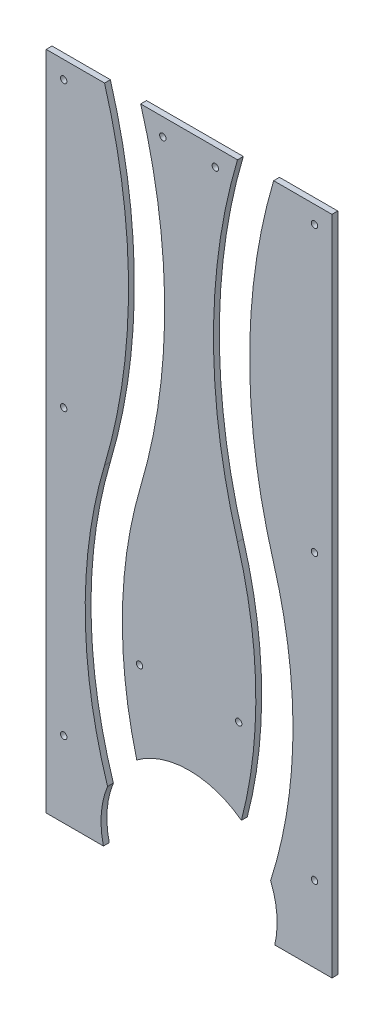
ISO-10303-21;
HEADER;
FILE_DESCRIPTION(('STEP AP214'),'2;1');
FILE_NAME('part.step','',(''),(''),'','','');
FILE_SCHEMA(('AUTOMOTIVE_DESIGN { 1 0 10303 214 1 1 1 1 }'));
ENDSEC;
DATA;
#1=APPLICATION_CONTEXT('core data for automotive mechanical design processes');
#2=APPLICATION_PROTOCOL_DEFINITION('international standard','automotive_design',2000,#1);
#3=PRODUCT_CONTEXT('',#1,'mechanical');
#4=PRODUCT('Part','Part','',(#3));
#5=PRODUCT_RELATED_PRODUCT_CATEGORY('part','',(#4));
#6=PRODUCT_DEFINITION_FORMATION('','',#4);
#7=PRODUCT_DEFINITION_CONTEXT('part definition',#1,'design');
#8=PRODUCT_DEFINITION('design','',#6,#7);
#9=PRODUCT_DEFINITION_SHAPE('','',#8);
#10=(LENGTH_UNIT() NAMED_UNIT(*) SI_UNIT(.MILLI.,.METRE.));
#11=(NAMED_UNIT(*) PLANE_ANGLE_UNIT() SI_UNIT($,.RADIAN.));
#12=(NAMED_UNIT(*) SI_UNIT($,.STERADIAN.) SOLID_ANGLE_UNIT());
#13=UNCERTAINTY_MEASURE_WITH_UNIT(LENGTH_MEASURE(1.E-05),#10,'distance_accuracy_value','');
#14=(GEOMETRIC_REPRESENTATION_CONTEXT(3) GLOBAL_UNCERTAINTY_ASSIGNED_CONTEXT((#13)) GLOBAL_UNIT_ASSIGNED_CONTEXT((#10,
#11,#12)) REPRESENTATION_CONTEXT('',''));
#15=CARTESIAN_POINT('',(0.,0.,0.));
#16=DIRECTION('',(0.,0.,1.));
#17=DIRECTION('',(1.,0.,0.));
#18=AXIS2_PLACEMENT_3D('',#15,#16,#17);
#19=CARTESIAN_POINT('',(0.,517.,5.));
#20=DIRECTION('',(0.,-1.,0.));
#21=DIRECTION('',(0.,0.,-1.));
#22=AXIS2_PLACEMENT_3D('',#19,#20,#21);
#23=PLANE('',#22);
#24=DIRECTION('',(0.,0.,1.));
#25=VECTOR('',#24,1.);
#26=CARTESIAN_POINT('',(50.,517.,-0.00100000000000013));
#27=LINE('',#26,#25);
#28=CARTESIAN_POINT('',(50.,517.,0.));
#29=VERTEX_POINT('',#28);
#30=CARTESIAN_POINT('',(50.,517.,5.));
#31=VERTEX_POINT('',#30);
#32=EDGE_CURVE('E77',#29,#31,#27,.T.);
#33=ORIENTED_EDGE('',*,*,#32,.F.);
#34=DIRECTION('',(-1.,0.,0.));
#35=VECTOR('',#34,1.);
#36=CARTESIAN_POINT('',(0.,517.,0.));
#37=LINE('',#36,#35);
#38=CARTESIAN_POINT('',(0.,517.,0.));
#39=VERTEX_POINT('',#38);
#40=EDGE_CURVE('E146',#29,#39,#37,.T.);
#41=ORIENTED_EDGE('',*,*,#40,.T.);
#42=DIRECTION('',(0.,0.,-1.));
#43=VECTOR('',#42,1.);
#44=CARTESIAN_POINT('',(0.,517.,5.));
#45=LINE('',#44,#43);
#46=CARTESIAN_POINT('',(0.,517.,5.));
#47=VERTEX_POINT('',#46);
#48=EDGE_CURVE('E122',#47,#39,#45,.T.);
#49=ORIENTED_EDGE('',*,*,#48,.F.);
#50=DIRECTION('',(-1.,0.,0.));
#51=VECTOR('',#50,1.);
#52=CARTESIAN_POINT('',(0.,517.,5.));
#53=LINE('',#52,#51);
#54=EDGE_CURVE('E95',#31,#47,#53,.T.);
#55=ORIENTED_EDGE('',*,*,#54,.F.);
#56=EDGE_LOOP('',(#33,#41,#49,#55));
#57=FACE_BOUND('',#56,.T.);
#58=ADVANCED_FACE('F53',(#57),#23,.F.);
#59=CARTESIAN_POINT('',(0.,0.,5.));
#60=DIRECTION('',(0.,0.,-1.));
#61=DIRECTION('',(-1.,0.,0.));
#62=AXIS2_PLACEMENT_3D('',#59,#60,#61);
#63=PLANE('',#62);
#64=CARTESIAN_POINT('',(15.,502.,5.));
#65=DIRECTION('',(0.,0.,1.));
#66=DIRECTION('',(1.,0.,0.));
#67=AXIS2_PLACEMENT_3D('',#64,#65,#66);
#68=CIRCLE('',#67,2.75);
#69=CARTESIAN_POINT('',(17.75,502.,5.));
#70=VERTEX_POINT('',#69);
#71=EDGE_CURVE('E178',#70,#70,#68,.T.);
#72=ORIENTED_EDGE('',*,*,#71,.F.);
#73=EDGE_LOOP('',(#72));
#74=FACE_BOUND('',#73,.T.);
#75=CARTESIAN_POINT('',(15.,15.,5.));
#76=DIRECTION('',(0.,0.,1.));
#77=DIRECTION('',(1.,0.,0.));
#78=AXIS2_PLACEMENT_3D('',#75,#76,#77);
#79=CIRCLE('',#78,2.75);
#80=CARTESIAN_POINT('',(17.75,15.,5.));
#81=VERTEX_POINT('',#80);
#82=EDGE_CURVE('E176',#81,#81,#79,.T.);
#83=ORIENTED_EDGE('',*,*,#82,.F.);
#84=EDGE_LOOP('',(#83));
#85=FACE_BOUND('',#84,.T.);
#86=CARTESIAN_POINT('',(15.,258.5,5.));
#87=DIRECTION('',(0.,0.,1.));
#88=DIRECTION('',(1.,0.,0.));
#89=AXIS2_PLACEMENT_3D('',#86,#87,#88);
#90=CIRCLE('',#89,2.75);
#91=CARTESIAN_POINT('',(17.75,258.5,5.));
#92=VERTEX_POINT('',#91);
#93=EDGE_CURVE('E166',#92,#92,#90,.T.);
#94=ORIENTED_EDGE('',*,*,#93,.F.);
#95=EDGE_LOOP('',(#94));
#96=FACE_BOUND('',#95,.T.);
#97=DIRECTION('',(0.,-1.,0.));
#98=VECTOR('',#97,1.);
#99=CARTESIAN_POINT('',(0.,0.,5.));
#100=LINE('',#99,#98);
#101=CARTESIAN_POINT('',(0.,-50.,5.));
#102=VERTEX_POINT('',#101);
#103=EDGE_CURVE('E158',#47,#102,#100,.T.);
#104=ORIENTED_EDGE('',*,*,#103,.T.);
#105=DIRECTION('',(1.,0.,0.));
#106=VECTOR('',#105,1.);
#107=CARTESIAN_POINT('',(-4.99999999999999,-50.,5.));
#108=LINE('',#107,#106);
#109=CARTESIAN_POINT('',(49.0561438920858,-50.,5.));
#110=VERTEX_POINT('',#109);
#111=EDGE_CURVE('E56',#102,#110,#108,.T.);
#112=ORIENTED_EDGE('',*,*,#111,.T.);
#113=CARTESIAN_POINT('',(122.5,-32.5,5.));
#114=DIRECTION('',(0.,0.,1.));
#115=DIRECTION('',(1.,0.,0.));
#116=AXIS2_PLACEMENT_3D('',#113,#114,#115);
#117=CIRCLE('',#116,75.5);
#118=CARTESIAN_POINT('',(52.5944637808592,-3.97867454141727,5.));
#119=VERTEX_POINT('',#118);
#120=EDGE_CURVE('E132',#119,#110,#117,.T.);
#121=ORIENTED_EDGE('',*,*,#120,.F.);
#122=CARTESIAN_POINT('',(436.22656914973,118.787308165063,5.));
#123=DIRECTION('',(0.,0.,-1.));
#124=DIRECTION('',(-1.,0.,0.));
#125=AXIS2_PLACEMENT_3D('',#122,#123,#124);
#126=CIRCLE('',#125,402.796572452696);
#127=CARTESIAN_POINT('',(50.,233.129409171076,5.));
#128=VERTEX_POINT('',#127);
#129=EDGE_CURVE('E62',#128,#119,#126,.F.);
#130=ORIENTED_EDGE('',*,*,#129,.F.);
#131=CARTESIAN_POINT('',(-429.431300517195,375.064704585538,5.));
#132=DIRECTION('',(0.,0.,-1.));
#133=DIRECTION('',(-1.,0.,0.));
#134=AXIS2_PLACEMENT_3D('',#131,#132,#133);
#135=CIRCLE('',#134,500.);
#136=EDGE_CURVE('E89',#31,#128,#135,.T.);
#137=ORIENTED_EDGE('',*,*,#136,.F.);
#138=ORIENTED_EDGE('',*,*,#54,.T.);
#139=EDGE_LOOP('',(#104,#112,#121,#130,#137,#138));
#140=FACE_BOUND('',#139,.T.);
#141=ADVANCED_FACE('F210',(#74,#85,#96,#140),#63,.F.);
#142=CARTESIAN_POINT('',(0.,0.,0.));
#143=DIRECTION('',(0.,0.,-1.));
#144=DIRECTION('',(-1.,0.,0.));
#145=AXIS2_PLACEMENT_3D('',#142,#143,#144);
#146=PLANE('',#145);
#147=DIRECTION('',(1.,0.,0.));
#148=VECTOR('',#147,1.);
#149=CARTESIAN_POINT('',(0.,-50.,0.));
#150=LINE('',#149,#148);
#151=CARTESIAN_POINT('',(0.,-50.,0.));
#152=VERTEX_POINT('',#151);
#153=CARTESIAN_POINT('',(49.0561438920858,-50.,0.));
#154=VERTEX_POINT('',#153);
#155=EDGE_CURVE('E127',#152,#154,#150,.T.);
#156=ORIENTED_EDGE('',*,*,#155,.F.);
#157=DIRECTION('',(0.,-1.,0.));
#158=VECTOR('',#157,1.);
#159=CARTESIAN_POINT('',(0.,0.,0.));
#160=LINE('',#159,#158);
#161=EDGE_CURVE('E116',#39,#152,#160,.T.);
#162=ORIENTED_EDGE('',*,*,#161,.F.);
#163=ORIENTED_EDGE('',*,*,#40,.F.);
#164=CARTESIAN_POINT('',(-429.431300517195,375.064704585538,0.));
#165=DIRECTION('',(0.,0.,-1.));
#166=DIRECTION('',(-1.,0.,0.));
#167=AXIS2_PLACEMENT_3D('',#164,#165,#166);
#168=CIRCLE('',#167,500.);
#169=CARTESIAN_POINT('',(50.,233.129409171076,0.));
#170=VERTEX_POINT('',#169);
#171=EDGE_CURVE('E141',#29,#170,#168,.T.);
#172=ORIENTED_EDGE('',*,*,#171,.T.);
#173=CARTESIAN_POINT('',(436.22656914973,118.787308165063,0.));
#174=DIRECTION('',(0.,0.,-1.));
#175=DIRECTION('',(-1.,0.,0.));
#176=AXIS2_PLACEMENT_3D('',#173,#174,#175);
#177=CIRCLE('',#176,402.796572452696);
#178=CARTESIAN_POINT('',(52.5944637808592,-3.97867454141743,0.));
#179=VERTEX_POINT('',#178);
#180=EDGE_CURVE('E138',#170,#179,#177,.F.);
#181=ORIENTED_EDGE('',*,*,#180,.T.);
#182=CARTESIAN_POINT('',(122.5,-32.5,0.));
#183=DIRECTION('',(0.,0.,-1.));
#184=DIRECTION('',(-1.,0.,0.));
#185=AXIS2_PLACEMENT_3D('',#182,#183,#184);
#186=CIRCLE('',#185,75.5);
#187=EDGE_CURVE('E68',#154,#179,#186,.T.);
#188=ORIENTED_EDGE('',*,*,#187,.F.);
#189=EDGE_LOOP('',(#156,#162,#163,#172,#181,#188));
#190=FACE_BOUND('',#189,.T.);
#191=CARTESIAN_POINT('',(15.,258.5,0.));
#192=DIRECTION('',(0.,0.,1.));
#193=DIRECTION('',(1.,0.,0.));
#194=AXIS2_PLACEMENT_3D('',#191,#192,#193);
#195=CIRCLE('',#194,2.75);
#196=CARTESIAN_POINT('',(17.75,258.5,0.));
#197=VERTEX_POINT('',#196);
#198=EDGE_CURVE('E160',#197,#197,#195,.T.);
#199=ORIENTED_EDGE('',*,*,#198,.T.);
#200=EDGE_LOOP('',(#199));
#201=FACE_BOUND('',#200,.T.);
#202=CARTESIAN_POINT('',(15.,15.,0.));
#203=DIRECTION('',(0.,0.,1.));
#204=DIRECTION('',(1.,0.,0.));
#205=AXIS2_PLACEMENT_3D('',#202,#203,#204);
#206=CIRCLE('',#205,2.75);
#207=CARTESIAN_POINT('',(17.75,15.,0.));
#208=VERTEX_POINT('',#207);
#209=EDGE_CURVE('E165',#208,#208,#206,.T.);
#210=ORIENTED_EDGE('',*,*,#209,.T.);
#211=EDGE_LOOP('',(#210));
#212=FACE_BOUND('',#211,.T.);
#213=CARTESIAN_POINT('',(15.,502.,0.));
#214=DIRECTION('',(0.,0.,1.));
#215=DIRECTION('',(1.,0.,0.));
#216=AXIS2_PLACEMENT_3D('',#213,#214,#215);
#217=CIRCLE('',#216,2.75);
#218=CARTESIAN_POINT('',(17.75,502.,0.));
#219=VERTEX_POINT('',#218);
#220=EDGE_CURVE('E175',#219,#219,#217,.T.);
#221=ORIENTED_EDGE('',*,*,#220,.T.);
#222=EDGE_LOOP('',(#221));
#223=FACE_BOUND('',#222,.T.);
#224=ADVANCED_FACE('F134',(#190,#201,#212,#223),#146,.T.);
#225=CARTESIAN_POINT('',(0.,-50.,5.));
#226=DIRECTION('',(0.,1.,0.));
#227=DIRECTION('',(0.,0.,1.));
#228=AXIS2_PLACEMENT_3D('',#225,#226,#227);
#229=PLANE('',#228);
#230=ORIENTED_EDGE('',*,*,#111,.F.);
#231=DIRECTION('',(0.,0.,-1.));
#232=VECTOR('',#231,1.);
#233=CARTESIAN_POINT('',(0.,-50.,5.0015));
#234=LINE('',#233,#232);
#235=EDGE_CURVE('E120',#102,#152,#234,.T.);
#236=ORIENTED_EDGE('',*,*,#235,.T.);
#237=ORIENTED_EDGE('',*,*,#155,.T.);
#238=DIRECTION('',(0.,0.,1.));
#239=VECTOR('',#238,1.);
#240=CARTESIAN_POINT('',(49.0561438920858,-50.,-2.49999999998515E-05));
#241=LINE('',#240,#239);
#242=EDGE_CURVE('E201',#154,#110,#241,.T.);
#243=ORIENTED_EDGE('',*,*,#242,.T.);
#244=EDGE_LOOP('',(#230,#236,#237,#243));
#245=FACE_BOUND('',#244,.T.);
#246=ADVANCED_FACE('F130',(#245),#229,.F.);
#247=CARTESIAN_POINT('',(0.,0.,5.));
#248=DIRECTION('',(1.,0.,0.));
#249=DIRECTION('',(0.,0.,-1.));
#250=AXIS2_PLACEMENT_3D('',#247,#248,#249);
#251=PLANE('',#250);
#252=ORIENTED_EDGE('',*,*,#161,.T.);
#253=ORIENTED_EDGE('',*,*,#235,.F.);
#254=ORIENTED_EDGE('',*,*,#103,.F.);
#255=ORIENTED_EDGE('',*,*,#48,.T.);
#256=EDGE_LOOP('',(#252,#253,#254,#255));
#257=FACE_BOUND('',#256,.T.);
#258=ADVANCED_FACE('F118',(#257),#251,.F.);
#259=CARTESIAN_POINT('',(15.,258.5,5.));
#260=DIRECTION('',(0.,0.,1.));
#261=DIRECTION('',(1.,0.,0.));
#262=AXIS2_PLACEMENT_3D('',#259,#260,#261);
#263=CYLINDRICAL_SURFACE('',#262,2.75);
#264=ORIENTED_EDGE('',*,*,#198,.F.);
#265=EDGE_LOOP('',(#264));
#266=FACE_BOUND('',#265,.T.);
#267=ORIENTED_EDGE('',*,*,#93,.T.);
#268=EDGE_LOOP('',(#267));
#269=FACE_BOUND('',#268,.T.);
#270=ADVANCED_FACE('F238',(#266,#269),#263,.F.);
#271=CARTESIAN_POINT('',(15.,15.,5.));
#272=DIRECTION('',(0.,0.,1.));
#273=DIRECTION('',(1.,0.,0.));
#274=AXIS2_PLACEMENT_3D('',#271,#272,#273);
#275=CYLINDRICAL_SURFACE('',#274,2.75);
#276=ORIENTED_EDGE('',*,*,#209,.F.);
#277=EDGE_LOOP('',(#276));
#278=FACE_BOUND('',#277,.T.);
#279=ORIENTED_EDGE('',*,*,#82,.T.);
#280=EDGE_LOOP('',(#279));
#281=FACE_BOUND('',#280,.T.);
#282=ADVANCED_FACE('F243',(#278,#281),#275,.F.);
#283=CARTESIAN_POINT('',(15.,502.,5.));
#284=DIRECTION('',(0.,0.,1.));
#285=DIRECTION('',(1.,0.,0.));
#286=AXIS2_PLACEMENT_3D('',#283,#284,#285);
#287=CYLINDRICAL_SURFACE('',#286,2.75);
#288=ORIENTED_EDGE('',*,*,#220,.F.);
#289=EDGE_LOOP('',(#288));
#290=FACE_BOUND('',#289,.T.);
#291=ORIENTED_EDGE('',*,*,#71,.T.);
#292=EDGE_LOOP('',(#291));
#293=FACE_BOUND('',#292,.T.);
#294=ADVANCED_FACE('F220',(#290,#293),#287,.F.);
#295=CARTESIAN_POINT('',(-429.431300517195,375.064704585538,5.000012));
#296=DIRECTION('',(0.,0.,-1.));
#297=DIRECTION('',(-1.,0.,0.));
#298=AXIS2_PLACEMENT_3D('',#295,#296,#297);
#299=CYLINDRICAL_SURFACE('',#298,500.);
#300=ORIENTED_EDGE('',*,*,#136,.T.);
#301=DIRECTION('',(0.,0.,-1.));
#302=VECTOR('',#301,1.);
#303=CARTESIAN_POINT('',(50.,233.129409171076,5.000012));
#304=LINE('',#303,#302);
#305=EDGE_CURVE('E86',#128,#170,#304,.T.);
#306=ORIENTED_EDGE('',*,*,#305,.T.);
#307=ORIENTED_EDGE('',*,*,#171,.F.);
#308=ORIENTED_EDGE('',*,*,#32,.T.);
#309=EDGE_LOOP('',(#300,#306,#307,#308));
#310=FACE_BOUND('',#309,.T.);
#311=ADVANCED_FACE('F199',(#310),#299,.T.);
#312=CARTESIAN_POINT('',(436.22656914973,118.787308165063,5.000012));
#313=DIRECTION('',(0.,0.,-1.));
#314=DIRECTION('',(-1.,0.,0.));
#315=AXIS2_PLACEMENT_3D('',#312,#313,#314);
#316=CYLINDRICAL_SURFACE('',#315,402.796572452696);
#317=DIRECTION('',(0.,0.,1.));
#318=VECTOR('',#317,1.);
#319=CARTESIAN_POINT('',(52.5944637808592,-3.9786745414174,2.4999875));
#320=LINE('',#319,#318);
#321=EDGE_CURVE('E13',#179,#119,#320,.T.);
#322=ORIENTED_EDGE('',*,*,#321,.F.);
#323=ORIENTED_EDGE('',*,*,#180,.F.);
#324=ORIENTED_EDGE('',*,*,#305,.F.);
#325=ORIENTED_EDGE('',*,*,#129,.T.);
#326=EDGE_LOOP('',(#322,#323,#324,#325));
#327=FACE_BOUND('',#326,.T.);
#328=ADVANCED_FACE('F212',(#327),#316,.F.);
#329=CARTESIAN_POINT('',(122.5,-32.5,-2.49999999998515E-05));
#330=DIRECTION('',(0.,0.,1.));
#331=DIRECTION('',(1.,0.,0.));
#332=AXIS2_PLACEMENT_3D('',#329,#330,#331);
#333=CYLINDRICAL_SURFACE('',#332,75.5);
#334=ORIENTED_EDGE('',*,*,#187,.T.);
#335=ORIENTED_EDGE('',*,*,#321,.T.);
#336=ORIENTED_EDGE('',*,*,#120,.T.);
#337=ORIENTED_EDGE('',*,*,#242,.F.);
#338=EDGE_LOOP('',(#334,#335,#336,#337));
#339=FACE_BOUND('',#338,.T.);
#340=ADVANCED_FACE('F208',(#339),#333,.F.);
#341=CLOSED_SHELL('',(#58,#141,#224,#246,#258,#270,#282,#294,#311,#328,#340));
#342=MANIFOLD_SOLID_BREP('B2',#341);
#343=CARTESIAN_POINT('',(230.,502.,5.));
#344=DIRECTION('',(0.,0.,1.));
#345=DIRECTION('',(1.,0.,0.));
#346=AXIS2_PLACEMENT_3D('',#343,#344,#345);
#347=CYLINDRICAL_SURFACE('',#346,2.75);
#348=CARTESIAN_POINT('',(230.,502.,0.));
#349=DIRECTION('',(0.,0.,1.));
#350=DIRECTION('',(1.,0.,0.));
#351=AXIS2_PLACEMENT_3D('',#348,#349,#350);
#352=CIRCLE('',#351,2.75);
#353=CARTESIAN_POINT('',(232.75,502.,0.));
#354=VERTEX_POINT('',#353);
#355=EDGE_CURVE('E435',#354,#354,#352,.T.);
#356=ORIENTED_EDGE('',*,*,#355,.F.);
#357=EDGE_LOOP('',(#356));
#358=FACE_BOUND('',#357,.T.);
#359=CARTESIAN_POINT('',(230.,502.,5.));
#360=DIRECTION('',(0.,0.,1.));
#361=DIRECTION('',(1.,0.,0.));
#362=AXIS2_PLACEMENT_3D('',#359,#360,#361);
#363=CIRCLE('',#362,2.75);
#364=CARTESIAN_POINT('',(232.75,502.,5.));
#365=VERTEX_POINT('',#364);
#366=EDGE_CURVE('E410',#365,#365,#363,.T.);
#367=ORIENTED_EDGE('',*,*,#366,.T.);
#368=EDGE_LOOP('',(#367));
#369=FACE_BOUND('',#368,.T.);
#370=ADVANCED_FACE('F350',(#358,#369),#347,.F.);
#371=CARTESIAN_POINT('',(230.,258.5,5.));
#372=DIRECTION('',(0.,0.,1.));
#373=DIRECTION('',(1.,0.,0.));
#374=AXIS2_PLACEMENT_3D('',#371,#372,#373);
#375=CYLINDRICAL_SURFACE('',#374,2.75);
#376=CARTESIAN_POINT('',(230.,258.5,0.));
#377=DIRECTION('',(0.,0.,1.));
#378=DIRECTION('',(1.,0.,0.));
#379=AXIS2_PLACEMENT_3D('',#376,#377,#378);
#380=CIRCLE('',#379,2.75);
#381=CARTESIAN_POINT('',(232.75,258.5,0.));
#382=VERTEX_POINT('',#381);
#383=EDGE_CURVE('E470',#382,#382,#380,.T.);
#384=ORIENTED_EDGE('',*,*,#383,.F.);
#385=EDGE_LOOP('',(#384));
#386=FACE_BOUND('',#385,.T.);
#387=CARTESIAN_POINT('',(230.,258.5,5.));
#388=DIRECTION('',(0.,0.,1.));
#389=DIRECTION('',(1.,0.,0.));
#390=AXIS2_PLACEMENT_3D('',#387,#388,#389);
#391=CIRCLE('',#390,2.75);
#392=CARTESIAN_POINT('',(232.75,258.5,5.));
#393=VERTEX_POINT('',#392);
#394=EDGE_CURVE('E473',#393,#393,#391,.T.);
#395=ORIENTED_EDGE('',*,*,#394,.T.);
#396=EDGE_LOOP('',(#395));
#397=FACE_BOUND('',#396,.T.);
#398=ADVANCED_FACE('F510',(#386,#397),#375,.F.);
#399=CARTESIAN_POINT('',(230.,15.,5.));
#400=DIRECTION('',(0.,0.,1.));
#401=DIRECTION('',(1.,0.,0.));
#402=AXIS2_PLACEMENT_3D('',#399,#400,#401);
#403=CYLINDRICAL_SURFACE('',#402,2.75);
#404=CARTESIAN_POINT('',(230.,15.,0.));
#405=DIRECTION('',(0.,0.,1.));
#406=DIRECTION('',(1.,0.,0.));
#407=AXIS2_PLACEMENT_3D('',#404,#405,#406);
#408=CIRCLE('',#407,2.75);
#409=CARTESIAN_POINT('',(232.75,15.,0.));
#410=VERTEX_POINT('',#409);
#411=EDGE_CURVE('E478',#410,#410,#408,.T.);
#412=ORIENTED_EDGE('',*,*,#411,.F.);
#413=EDGE_LOOP('',(#412));
#414=FACE_BOUND('',#413,.T.);
#415=CARTESIAN_POINT('',(230.,15.,5.));
#416=DIRECTION('',(0.,0.,1.));
#417=DIRECTION('',(1.,0.,0.));
#418=AXIS2_PLACEMENT_3D('',#415,#416,#417);
#419=CIRCLE('',#418,2.75);
#420=CARTESIAN_POINT('',(232.75,15.,5.));
#421=VERTEX_POINT('',#420);
#422=EDGE_CURVE('E465',#421,#421,#419,.T.);
#423=ORIENTED_EDGE('',*,*,#422,.T.);
#424=EDGE_LOOP('',(#423));
#425=FACE_BOUND('',#424,.T.);
#426=ADVANCED_FACE('F516',(#414,#425),#403,.F.);
#427=CARTESIAN_POINT('',(245.,0.,5.));
#428=DIRECTION('',(-1.,0.,0.));
#429=DIRECTION('',(0.,0.,1.));
#430=AXIS2_PLACEMENT_3D('',#427,#428,#429);
#431=PLANE('',#430);
#432=DIRECTION('',(0.,1.,0.));
#433=VECTOR('',#432,1.);
#434=CARTESIAN_POINT('',(245.,0.,0.));
#435=LINE('',#434,#433);
#436=CARTESIAN_POINT('',(245.,-50.,0.));
#437=VERTEX_POINT('',#436);
#438=CARTESIAN_POINT('',(245.,517.,0.));
#439=VERTEX_POINT('',#438);
#440=EDGE_CURVE('E462',#437,#439,#435,.T.);
#441=ORIENTED_EDGE('',*,*,#440,.T.);
#442=DIRECTION('',(0.,0.,-1.));
#443=VECTOR('',#442,1.);
#444=CARTESIAN_POINT('',(245.,517.,5.));
#445=LINE('',#444,#443);
#446=CARTESIAN_POINT('',(245.,517.,5.));
#447=VERTEX_POINT('',#446);
#448=EDGE_CURVE('E450',#447,#439,#445,.T.);
#449=ORIENTED_EDGE('',*,*,#448,.F.);
#450=DIRECTION('',(0.,1.,0.));
#451=VECTOR('',#450,1.);
#452=CARTESIAN_POINT('',(245.,0.,5.));
#453=LINE('',#452,#451);
#454=CARTESIAN_POINT('',(245.,-50.,5.));
#455=VERTEX_POINT('',#454);
#456=EDGE_CURVE('E423',#455,#447,#453,.T.);
#457=ORIENTED_EDGE('',*,*,#456,.F.);
#458=DIRECTION('',(0.,0.,-1.));
#459=VECTOR('',#458,1.);
#460=CARTESIAN_POINT('',(245.,-50.,5.));
#461=LINE('',#460,#459);
#462=EDGE_CURVE('E422',#455,#437,#461,.T.);
#463=ORIENTED_EDGE('',*,*,#462,.T.);
#464=EDGE_LOOP('',(#441,#449,#457,#463));
#465=FACE_BOUND('',#464,.T.);
#466=ADVANCED_FACE('F522',(#465),#431,.F.);
#467=CARTESIAN_POINT('',(0.,-50.,5.));
#468=DIRECTION('',(0.,1.,0.));
#469=DIRECTION('',(0.,0.,1.));
#470=AXIS2_PLACEMENT_3D('',#467,#468,#469);
#471=PLANE('',#470);
#472=DIRECTION('',(1.,0.,0.));
#473=VECTOR('',#472,1.);
#474=CARTESIAN_POINT('',(-4.99999999999999,-50.,5.));
#475=LINE('',#474,#473);
#476=CARTESIAN_POINT('',(195.943856107914,-50.,5.));
#477=VERTEX_POINT('',#476);
#478=EDGE_CURVE('E354',#477,#455,#475,.T.);
#479=ORIENTED_EDGE('',*,*,#478,.F.);
#480=DIRECTION('',(0.,0.,1.));
#481=VECTOR('',#480,1.);
#482=CARTESIAN_POINT('',(195.943856107914,-50.,-2.49999999998515E-05));
#483=LINE('',#482,#481);
#484=CARTESIAN_POINT('',(195.943856107914,-50.,0.));
#485=VERTEX_POINT('',#484);
#486=EDGE_CURVE('E403',#477,#485,#483,.F.);
#487=ORIENTED_EDGE('',*,*,#486,.T.);
#488=DIRECTION('',(1.,0.,0.));
#489=VECTOR('',#488,1.);
#490=CARTESIAN_POINT('',(0.,-50.,0.));
#491=LINE('',#490,#489);
#492=EDGE_CURVE('E455',#485,#437,#491,.T.);
#493=ORIENTED_EDGE('',*,*,#492,.T.);
#494=ORIENTED_EDGE('',*,*,#462,.F.);
#495=EDGE_LOOP('',(#479,#487,#493,#494));
#496=FACE_BOUND('',#495,.T.);
#497=ADVANCED_FACE('F420',(#496),#471,.F.);
#498=CARTESIAN_POINT('',(0.,0.,0.));
#499=DIRECTION('',(0.,0.,-1.));
#500=DIRECTION('',(-1.,0.,0.));
#501=AXIS2_PLACEMENT_3D('',#498,#499,#500);
#502=PLANE('',#501);
#503=CARTESIAN_POINT('',(122.5,-32.5,0.));
#504=DIRECTION('',(0.,0.,-1.));
#505=DIRECTION('',(-1.,0.,0.));
#506=AXIS2_PLACEMENT_3D('',#503,#504,#505);
#507=CIRCLE('',#506,75.5);
#508=CARTESIAN_POINT('',(192.405536219141,-3.97867454141729,0.));
#509=VERTEX_POINT('',#508);
#510=EDGE_CURVE('E406',#509,#485,#507,.T.);
#511=ORIENTED_EDGE('',*,*,#510,.F.);
#512=CARTESIAN_POINT('',(-191.22656914973,118.787308165063,0.));
#513=DIRECTION('',(0.,0.,-1.));
#514=DIRECTION('',(-1.,0.,0.));
#515=AXIS2_PLACEMENT_3D('',#512,#513,#514);
#516=CIRCLE('',#515,402.796572452696);
#517=CARTESIAN_POINT('',(195.,233.129409171076,0.));
#518=VERTEX_POINT('',#517);
#519=EDGE_CURVE('E428',#509,#518,#516,.F.);
#520=ORIENTED_EDGE('',*,*,#519,.T.);
#521=CARTESIAN_POINT('',(674.431300517196,375.064704585538,0.));
#522=DIRECTION('',(0.,0.,-1.));
#523=DIRECTION('',(-1.,0.,0.));
#524=AXIS2_PLACEMENT_3D('',#521,#522,#523);
#525=CIRCLE('',#524,500.);
#526=CARTESIAN_POINT('',(195.,517.,0.));
#527=VERTEX_POINT('',#526);
#528=EDGE_CURVE('E424',#518,#527,#525,.T.);
#529=ORIENTED_EDGE('',*,*,#528,.T.);
#530=DIRECTION('',(-1.,0.,0.));
#531=VECTOR('',#530,1.);
#532=CARTESIAN_POINT('',(0.,517.,0.));
#533=LINE('',#532,#531);
#534=EDGE_CURVE('E448',#439,#527,#533,.T.);
#535=ORIENTED_EDGE('',*,*,#534,.F.);
#536=ORIENTED_EDGE('',*,*,#440,.F.);
#537=ORIENTED_EDGE('',*,*,#492,.F.);
#538=EDGE_LOOP('',(#511,#520,#529,#535,#536,#537));
#539=FACE_BOUND('',#538,.T.);
#540=ORIENTED_EDGE('',*,*,#411,.T.);
#541=EDGE_LOOP('',(#540));
#542=FACE_BOUND('',#541,.T.);
#543=ORIENTED_EDGE('',*,*,#383,.T.);
#544=EDGE_LOOP('',(#543));
#545=FACE_BOUND('',#544,.T.);
#546=ORIENTED_EDGE('',*,*,#355,.T.);
#547=EDGE_LOOP('',(#546));
#548=FACE_BOUND('',#547,.T.);
#549=ADVANCED_FACE('F535',(#539,#542,#545,#548),#502,.T.);
#550=CARTESIAN_POINT('',(0.,0.,5.));
#551=DIRECTION('',(0.,0.,-1.));
#552=DIRECTION('',(-1.,0.,0.));
#553=AXIS2_PLACEMENT_3D('',#550,#551,#552);
#554=PLANE('',#553);
#555=ORIENTED_EDGE('',*,*,#366,.F.);
#556=EDGE_LOOP('',(#555));
#557=FACE_BOUND('',#556,.T.);
#558=ORIENTED_EDGE('',*,*,#394,.F.);
#559=EDGE_LOOP('',(#558));
#560=FACE_BOUND('',#559,.T.);
#561=ORIENTED_EDGE('',*,*,#422,.F.);
#562=EDGE_LOOP('',(#561));
#563=FACE_BOUND('',#562,.T.);
#564=CARTESIAN_POINT('',(-191.22656914973,118.787308165063,5.));
#565=DIRECTION('',(0.,0.,-1.));
#566=DIRECTION('',(-1.,0.,0.));
#567=AXIS2_PLACEMENT_3D('',#564,#565,#566);
#568=CIRCLE('',#567,402.796572452696);
#569=CARTESIAN_POINT('',(192.405536219141,-3.97867454141727,5.));
#570=VERTEX_POINT('',#569);
#571=CARTESIAN_POINT('',(195.,233.129409171076,5.));
#572=VERTEX_POINT('',#571);
#573=EDGE_CURVE('E417',#570,#572,#568,.F.);
#574=ORIENTED_EDGE('',*,*,#573,.F.);
#575=CARTESIAN_POINT('',(122.5,-32.5,5.));
#576=DIRECTION('',(0.,0.,1.));
#577=DIRECTION('',(1.,0.,0.));
#578=AXIS2_PLACEMENT_3D('',#575,#576,#577);
#579=CIRCLE('',#578,75.5);
#580=EDGE_CURVE('E366',#477,#570,#579,.T.);
#581=ORIENTED_EDGE('',*,*,#580,.F.);
#582=ORIENTED_EDGE('',*,*,#478,.T.);
#583=ORIENTED_EDGE('',*,*,#456,.T.);
#584=DIRECTION('',(-1.,0.,0.));
#585=VECTOR('',#584,1.);
#586=CARTESIAN_POINT('',(0.,517.,5.));
#587=LINE('',#586,#585);
#588=CARTESIAN_POINT('',(195.,517.,5.));
#589=VERTEX_POINT('',#588);
#590=EDGE_CURVE('E425',#447,#589,#587,.T.);
#591=ORIENTED_EDGE('',*,*,#590,.T.);
#592=CARTESIAN_POINT('',(674.431300517196,375.064704585538,5.));
#593=DIRECTION('',(0.,0.,-1.));
#594=DIRECTION('',(-1.,0.,0.));
#595=AXIS2_PLACEMENT_3D('',#592,#593,#594);
#596=CIRCLE('',#595,500.);
#597=EDGE_CURVE('E360',#572,#589,#596,.T.);
#598=ORIENTED_EDGE('',*,*,#597,.F.);
#599=EDGE_LOOP('',(#574,#581,#582,#583,#591,#598));
#600=FACE_BOUND('',#599,.T.);
#601=ADVANCED_FACE('F414',(#557,#560,#563,#600),#554,.F.);
#602=CARTESIAN_POINT('',(0.,517.,5.));
#603=DIRECTION('',(0.,-1.,0.));
#604=DIRECTION('',(0.,0.,-1.));
#605=AXIS2_PLACEMENT_3D('',#602,#603,#604);
#606=PLANE('',#605);
#607=DIRECTION('',(0.,0.,1.));
#608=VECTOR('',#607,1.);
#609=CARTESIAN_POINT('',(195.,517.,-0.00100000000000013));
#610=LINE('',#609,#608);
#611=EDGE_CURVE('E374',#527,#589,#610,.T.);
#612=ORIENTED_EDGE('',*,*,#611,.T.);
#613=ORIENTED_EDGE('',*,*,#590,.F.);
#614=ORIENTED_EDGE('',*,*,#448,.T.);
#615=ORIENTED_EDGE('',*,*,#534,.T.);
#616=EDGE_LOOP('',(#612,#613,#614,#615));
#617=FACE_BOUND('',#616,.T.);
#618=ADVANCED_FACE('F352',(#617),#606,.F.);
#619=CARTESIAN_POINT('',(-191.22656914973,118.787308165063,5.000012));
#620=DIRECTION('',(0.,0.,-1.));
#621=DIRECTION('',(-1.,0.,0.));
#622=AXIS2_PLACEMENT_3D('',#619,#620,#621);
#623=CYLINDRICAL_SURFACE('',#622,402.796572452696);
#624=DIRECTION('',(0.,0.,1.));
#625=VECTOR('',#624,1.);
#626=CARTESIAN_POINT('',(192.405536219141,-3.97867454141738,2.4999875));
#627=LINE('',#626,#625);
#628=EDGE_CURVE('E51',#570,#509,#627,.F.);
#629=ORIENTED_EDGE('',*,*,#628,.F.);
#630=ORIENTED_EDGE('',*,*,#573,.T.);
#631=DIRECTION('',(0.,0.,-1.));
#632=VECTOR('',#631,1.);
#633=CARTESIAN_POINT('',(195.,233.129409171076,5.000012));
#634=LINE('',#633,#632);
#635=EDGE_CURVE('E491',#572,#518,#634,.T.);
#636=ORIENTED_EDGE('',*,*,#635,.T.);
#637=ORIENTED_EDGE('',*,*,#519,.F.);
#638=EDGE_LOOP('',(#629,#630,#636,#637));
#639=FACE_BOUND('',#638,.T.);
#640=ADVANCED_FACE('F498',(#639),#623,.F.);
#641=CARTESIAN_POINT('',(674.431300517196,375.064704585538,5.000012));
#642=DIRECTION('',(0.,0.,-1.));
#643=DIRECTION('',(-1.,0.,0.));
#644=AXIS2_PLACEMENT_3D('',#641,#642,#643);
#645=CYLINDRICAL_SURFACE('',#644,500.);
#646=ORIENTED_EDGE('',*,*,#597,.T.);
#647=ORIENTED_EDGE('',*,*,#611,.F.);
#648=ORIENTED_EDGE('',*,*,#528,.F.);
#649=ORIENTED_EDGE('',*,*,#635,.F.);
#650=EDGE_LOOP('',(#646,#647,#648,#649));
#651=FACE_BOUND('',#650,.T.);
#652=ADVANCED_FACE('F499',(#651),#645,.T.);
#653=CARTESIAN_POINT('',(122.5,-32.5,-2.49999999998515E-05));
#654=DIRECTION('',(0.,0.,1.));
#655=DIRECTION('',(1.,0.,0.));
#656=AXIS2_PLACEMENT_3D('',#653,#654,#655);
#657=CYLINDRICAL_SURFACE('',#656,75.5);
#658=ORIENTED_EDGE('',*,*,#580,.T.);
#659=ORIENTED_EDGE('',*,*,#628,.T.);
#660=ORIENTED_EDGE('',*,*,#510,.T.);
#661=ORIENTED_EDGE('',*,*,#486,.F.);
#662=EDGE_LOOP('',(#658,#659,#660,#661));
#663=FACE_BOUND('',#662,.T.);
#664=ADVANCED_FACE('F404',(#663),#657,.F.);
#665=CLOSED_SHELL('',(#370,#398,#426,#466,#497,#549,#601,#618,#640,#652,#664));
#666=MANIFOLD_SOLID_BREP('B7',#665);
#667=CARTESIAN_POINT('',(165.,100.,5.));
#668=DIRECTION('',(0.,0.,1.));
#669=DIRECTION('',(1.,0.,0.));
#670=AXIS2_PLACEMENT_3D('',#667,#668,#669);
#671=CYLINDRICAL_SURFACE('',#670,2.75);
#672=CARTESIAN_POINT('',(165.,100.,0.));
#673=DIRECTION('',(0.,0.,1.));
#674=DIRECTION('',(1.,0.,0.));
#675=AXIS2_PLACEMENT_3D('',#672,#673,#674);
#676=CIRCLE('',#675,2.75);
#677=CARTESIAN_POINT('',(167.75,100.,0.));
#678=VERTEX_POINT('',#677);
#679=EDGE_CURVE('E725',#678,#678,#676,.T.);
#680=ORIENTED_EDGE('',*,*,#679,.F.);
#681=EDGE_LOOP('',(#680));
#682=FACE_BOUND('',#681,.T.);
#683=CARTESIAN_POINT('',(165.,100.,5.));
#684=DIRECTION('',(0.,0.,1.));
#685=DIRECTION('',(1.,0.,0.));
#686=AXIS2_PLACEMENT_3D('',#683,#684,#685);
#687=CIRCLE('',#686,2.75);
#688=CARTESIAN_POINT('',(167.75,100.,5.));
#689=VERTEX_POINT('',#688);
#690=EDGE_CURVE('E730',#689,#689,#687,.T.);
#691=ORIENTED_EDGE('',*,*,#690,.T.);
#692=EDGE_LOOP('',(#691));
#693=FACE_BOUND('',#692,.T.);
#694=ADVANCED_FACE('F634',(#682,#693),#671,.F.);
#695=CARTESIAN_POINT('',(80.,100.,5.));
#696=DIRECTION('',(0.,0.,1.));
#697=DIRECTION('',(1.,0.,0.));
#698=AXIS2_PLACEMENT_3D('',#695,#696,#697);
#699=CYLINDRICAL_SURFACE('',#698,2.75);
#700=CARTESIAN_POINT('',(80.,100.,0.));
#701=DIRECTION('',(0.,0.,1.));
#702=DIRECTION('',(1.,0.,0.));
#703=AXIS2_PLACEMENT_3D('',#700,#701,#702);
#704=CIRCLE('',#703,2.75);
#705=CARTESIAN_POINT('',(82.75,100.,0.));
#706=VERTEX_POINT('',#705);
#707=EDGE_CURVE('E733',#706,#706,#704,.T.);
#708=ORIENTED_EDGE('',*,*,#707,.F.);
#709=EDGE_LOOP('',(#708));
#710=FACE_BOUND('',#709,.T.);
#711=CARTESIAN_POINT('',(80.,100.,5.));
#712=DIRECTION('',(0.,0.,1.));
#713=DIRECTION('',(1.,0.,0.));
#714=AXIS2_PLACEMENT_3D('',#711,#712,#713);
#715=CIRCLE('',#714,2.75);
#716=CARTESIAN_POINT('',(82.75,100.,5.));
#717=VERTEX_POINT('',#716);
#718=EDGE_CURVE('E738',#717,#717,#715,.T.);
#719=ORIENTED_EDGE('',*,*,#718,.T.);
#720=EDGE_LOOP('',(#719));
#721=FACE_BOUND('',#720,.T.);
#722=ADVANCED_FACE('F815',(#710,#721),#699,.F.);
#723=CARTESIAN_POINT('',(145.,502.,5.));
#724=DIRECTION('',(0.,0.,1.));
#725=DIRECTION('',(1.,0.,0.));
#726=AXIS2_PLACEMENT_3D('',#723,#724,#725);
#727=CYLINDRICAL_SURFACE('',#726,2.75);
#728=CARTESIAN_POINT('',(145.,502.,0.));
#729=DIRECTION('',(0.,0.,1.));
#730=DIRECTION('',(1.,0.,0.));
#731=AXIS2_PLACEMENT_3D('',#728,#729,#730);
#732=CIRCLE('',#731,2.75);
#733=CARTESIAN_POINT('',(147.75,502.,0.));
#734=VERTEX_POINT('',#733);
#735=EDGE_CURVE('E744',#734,#734,#732,.T.);
#736=ORIENTED_EDGE('',*,*,#735,.F.);
#737=EDGE_LOOP('',(#736));
#738=FACE_BOUND('',#737,.T.);
#739=CARTESIAN_POINT('',(145.,502.,5.));
#740=DIRECTION('',(0.,0.,1.));
#741=DIRECTION('',(1.,0.,0.));
#742=AXIS2_PLACEMENT_3D('',#739,#740,#741);
#743=CIRCLE('',#742,2.75);
#744=CARTESIAN_POINT('',(147.75,502.,5.));
#745=VERTEX_POINT('',#744);
#746=EDGE_CURVE('E749',#745,#745,#743,.T.);
#747=ORIENTED_EDGE('',*,*,#746,.T.);
#748=EDGE_LOOP('',(#747));
#749=FACE_BOUND('',#748,.T.);
#750=ADVANCED_FACE('F821',(#738,#749),#727,.F.);
#751=CARTESIAN_POINT('',(100.,502.,5.));
#752=DIRECTION('',(0.,0.,1.));
#753=DIRECTION('',(1.,0.,0.));
#754=AXIS2_PLACEMENT_3D('',#751,#752,#753);
#755=CYLINDRICAL_SURFACE('',#754,2.75);
#756=CARTESIAN_POINT('',(100.,502.,0.));
#757=DIRECTION('',(0.,0.,1.));
#758=DIRECTION('',(1.,0.,0.));
#759=AXIS2_PLACEMENT_3D('',#756,#757,#758);
#760=CIRCLE('',#759,2.75);
#761=CARTESIAN_POINT('',(102.75,502.,0.));
#762=VERTEX_POINT('',#761);
#763=EDGE_CURVE('E751',#762,#762,#760,.T.);
#764=ORIENTED_EDGE('',*,*,#763,.F.);
#765=EDGE_LOOP('',(#764));
#766=FACE_BOUND('',#765,.T.);
#767=CARTESIAN_POINT('',(100.,502.,5.));
#768=DIRECTION('',(0.,0.,1.));
#769=DIRECTION('',(1.,0.,0.));
#770=AXIS2_PLACEMENT_3D('',#767,#768,#769);
#771=CIRCLE('',#770,2.75);
#772=CARTESIAN_POINT('',(102.75,502.,5.));
#773=VERTEX_POINT('',#772);
#774=EDGE_CURVE('E756',#773,#773,#771,.T.);
#775=ORIENTED_EDGE('',*,*,#774,.T.);
#776=EDGE_LOOP('',(#775));
#777=FACE_BOUND('',#776,.T.);
#778=ADVANCED_FACE('F831',(#766,#777),#755,.F.);
#779=CARTESIAN_POINT('',(0.,0.,0.));
#780=DIRECTION('',(0.,0.,-1.));
#781=DIRECTION('',(-1.,0.,0.));
#782=AXIS2_PLACEMENT_3D('',#779,#780,#781);
#783=PLANE('',#782);
#784=CARTESIAN_POINT('',(122.5,-32.5,0.));
#785=DIRECTION('',(0.,0.,-1.));
#786=DIRECTION('',(-1.,0.,0.));
#787=AXIS2_PLACEMENT_3D('',#784,#785,#786);
#788=CIRCLE('',#787,75.5);
#789=CARTESIAN_POINT('',(77.6337922589388,28.2229232080927,0.));
#790=VERTEX_POINT('',#789);
#791=CARTESIAN_POINT('',(167.366207741061,28.2229232080929,0.));
#792=VERTEX_POINT('',#791);
#793=EDGE_CURVE('E688',#790,#792,#788,.T.);
#794=ORIENTED_EDGE('',*,*,#793,.F.);
#795=CARTESIAN_POINT('',(447.498919740372,124.627664736963,0.));
#796=DIRECTION('',(0.,0.,-1.));
#797=DIRECTION('',(-1.,0.,0.));
#798=AXIS2_PLACEMENT_3D('',#795,#796,#797);
#799=CIRCLE('',#798,382.222561757028);
#800=CARTESIAN_POINT('',(81.,233.129409171076,0.));
#801=VERTEX_POINT('',#800);
#802=EDGE_CURVE('E778',#790,#801,#799,.T.);
#803=ORIENTED_EDGE('',*,*,#802,.T.);
#804=CARTESIAN_POINT('',(-398.431300517196,375.064704585538,0.));
#805=DIRECTION('',(0.,0.,-1.));
#806=DIRECTION('',(-1.,0.,0.));
#807=AXIS2_PLACEMENT_3D('',#804,#805,#806);
#808=CIRCLE('',#807,500.000000000001);
#809=CARTESIAN_POINT('',(80.9999999999999,517.,0.));
#810=VERTEX_POINT('',#809);
#811=EDGE_CURVE('E775',#801,#810,#808,.F.);
#812=ORIENTED_EDGE('',*,*,#811,.T.);
#813=DIRECTION('',(-1.,0.,0.));
#814=VECTOR('',#813,1.);
#815=CARTESIAN_POINT('',(0.,517.,0.));
#816=LINE('',#815,#814);
#817=CARTESIAN_POINT('',(164.,517.,0.));
#818=VERTEX_POINT('',#817);
#819=EDGE_CURVE('E722',#818,#810,#816,.T.);
#820=ORIENTED_EDGE('',*,*,#819,.F.);
#821=CARTESIAN_POINT('',(643.431300517196,375.064704585538,0.));
#822=DIRECTION('',(0.,0.,-1.));
#823=DIRECTION('',(-1.,0.,0.));
#824=AXIS2_PLACEMENT_3D('',#821,#822,#823);
#825=CIRCLE('',#824,500.000000000001);
#826=CARTESIAN_POINT('',(164.,233.129409171076,0.));
#827=VERTEX_POINT('',#826);
#828=EDGE_CURVE('E693',#818,#827,#825,.F.);
#829=ORIENTED_EDGE('',*,*,#828,.T.);
#830=CARTESIAN_POINT('',(-202.498919740372,124.627664736963,0.));
#831=DIRECTION('',(0.,0.,-1.));
#832=DIRECTION('',(-1.,0.,0.));
#833=AXIS2_PLACEMENT_3D('',#830,#831,#832);
#834=CIRCLE('',#833,382.222561757028);
#835=EDGE_CURVE('E787',#827,#792,#834,.T.);
#836=ORIENTED_EDGE('',*,*,#835,.T.);
#837=EDGE_LOOP('',(#794,#803,#812,#820,#829,#836));
#838=FACE_BOUND('',#837,.T.);
#839=ORIENTED_EDGE('',*,*,#763,.T.);
#840=EDGE_LOOP('',(#839));
#841=FACE_BOUND('',#840,.T.);
#842=ORIENTED_EDGE('',*,*,#735,.T.);
#843=EDGE_LOOP('',(#842));
#844=FACE_BOUND('',#843,.T.);
#845=ORIENTED_EDGE('',*,*,#707,.T.);
#846=EDGE_LOOP('',(#845));
#847=FACE_BOUND('',#846,.T.);
#848=ORIENTED_EDGE('',*,*,#679,.T.);
#849=EDGE_LOOP('',(#848));
#850=FACE_BOUND('',#849,.T.);
#851=ADVANCED_FACE('F802',(#838,#841,#844,#847,#850),#783,.T.);
#852=CARTESIAN_POINT('',(0.,0.,5.));
#853=DIRECTION('',(0.,0.,-1.));
#854=DIRECTION('',(-1.,0.,0.));
#855=AXIS2_PLACEMENT_3D('',#852,#853,#854);
#856=PLANE('',#855);
#857=ORIENTED_EDGE('',*,*,#774,.F.);
#858=EDGE_LOOP('',(#857));
#859=FACE_BOUND('',#858,.T.);
#860=ORIENTED_EDGE('',*,*,#746,.F.);
#861=EDGE_LOOP('',(#860));
#862=FACE_BOUND('',#861,.T.);
#863=ORIENTED_EDGE('',*,*,#718,.F.);
#864=EDGE_LOOP('',(#863));
#865=FACE_BOUND('',#864,.T.);
#866=ORIENTED_EDGE('',*,*,#690,.F.);
#867=EDGE_LOOP('',(#866));
#868=FACE_BOUND('',#867,.T.);
#869=CARTESIAN_POINT('',(447.498919740372,124.627664736963,5.));
#870=DIRECTION('',(0.,0.,-1.));
#871=DIRECTION('',(-1.,0.,0.));
#872=AXIS2_PLACEMENT_3D('',#869,#870,#871);
#873=CIRCLE('',#872,382.222561757028);
#874=CARTESIAN_POINT('',(77.6337922589388,28.2229232080929,5.));
#875=VERTEX_POINT('',#874);
#876=CARTESIAN_POINT('',(80.9999999999999,233.129409171076,5.));
#877=VERTEX_POINT('',#876);
#878=EDGE_CURVE('E655',#875,#877,#873,.T.);
#879=ORIENTED_EDGE('',*,*,#878,.F.);
#880=CARTESIAN_POINT('',(122.5,-32.5,5.));
#881=DIRECTION('',(0.,0.,1.));
#882=DIRECTION('',(1.,0.,0.));
#883=AXIS2_PLACEMENT_3D('',#880,#881,#882);
#884=CIRCLE('',#883,75.5);
#885=CARTESIAN_POINT('',(167.366207741061,28.2229232080929,5.));
#886=VERTEX_POINT('',#885);
#887=EDGE_CURVE('E648',#886,#875,#884,.T.);
#888=ORIENTED_EDGE('',*,*,#887,.F.);
#889=CARTESIAN_POINT('',(-202.498919740372,124.627664736963,5.));
#890=DIRECTION('',(0.,0.,-1.));
#891=DIRECTION('',(-1.,0.,0.));
#892=AXIS2_PLACEMENT_3D('',#889,#890,#891);
#893=CIRCLE('',#892,382.222561757028);
#894=CARTESIAN_POINT('',(164.,233.129409171076,5.));
#895=VERTEX_POINT('',#894);
#896=EDGE_CURVE('E699',#895,#886,#893,.T.);
#897=ORIENTED_EDGE('',*,*,#896,.F.);
#898=CARTESIAN_POINT('',(643.431300517196,375.064704585538,5.));
#899=DIRECTION('',(0.,0.,-1.));
#900=DIRECTION('',(-1.,0.,0.));
#901=AXIS2_PLACEMENT_3D('',#898,#899,#900);
#902=CIRCLE('',#901,500.000000000001);
#903=CARTESIAN_POINT('',(164.,517.,5.));
#904=VERTEX_POINT('',#903);
#905=EDGE_CURVE('E707',#904,#895,#902,.F.);
#906=ORIENTED_EDGE('',*,*,#905,.F.);
#907=DIRECTION('',(-1.,0.,0.));
#908=VECTOR('',#907,1.);
#909=CARTESIAN_POINT('',(0.,517.,5.));
#910=LINE('',#909,#908);
#911=CARTESIAN_POINT('',(81.,517.,5.));
#912=VERTEX_POINT('',#911);
#913=EDGE_CURVE('E642',#904,#912,#910,.T.);
#914=ORIENTED_EDGE('',*,*,#913,.T.);
#915=CARTESIAN_POINT('',(-398.431300517196,375.064704585538,5.));
#916=DIRECTION('',(0.,0.,-1.));
#917=DIRECTION('',(-1.,0.,0.));
#918=AXIS2_PLACEMENT_3D('',#915,#916,#917);
#919=CIRCLE('',#918,500.000000000001);
#920=EDGE_CURVE('E759',#877,#912,#919,.F.);
#921=ORIENTED_EDGE('',*,*,#920,.F.);
#922=EDGE_LOOP('',(#879,#888,#897,#906,#914,#921));
#923=FACE_BOUND('',#922,.T.);
#924=ADVANCED_FACE('F697',(#859,#862,#865,#868,#923),#856,.F.);
#925=CARTESIAN_POINT('',(0.,517.,5.));
#926=DIRECTION('',(0.,-1.,0.));
#927=DIRECTION('',(0.,0.,-1.));
#928=AXIS2_PLACEMENT_3D('',#925,#926,#927);
#929=PLANE('',#928);
#930=DIRECTION('',(0.,0.,1.));
#931=VECTOR('',#930,1.);
#932=CARTESIAN_POINT('',(81.,517.,-0.00100000000000013));
#933=LINE('',#932,#931);
#934=EDGE_CURVE('E708',#810,#912,#933,.T.);
#935=ORIENTED_EDGE('',*,*,#934,.T.);
#936=ORIENTED_EDGE('',*,*,#913,.F.);
#937=DIRECTION('',(0.,0.,1.));
#938=VECTOR('',#937,1.);
#939=CARTESIAN_POINT('',(164.,517.,-0.00100000000000013));
#940=LINE('',#939,#938);
#941=EDGE_CURVE('E768',#818,#904,#940,.T.);
#942=ORIENTED_EDGE('',*,*,#941,.F.);
#943=ORIENTED_EDGE('',*,*,#819,.T.);
#944=EDGE_LOOP('',(#935,#936,#942,#943));
#945=FACE_BOUND('',#944,.T.);
#946=ADVANCED_FACE('F636',(#945),#929,.F.);
#947=CARTESIAN_POINT('',(643.431300517196,375.064704585538,5.000012));
#948=DIRECTION('',(0.,0.,-1.));
#949=DIRECTION('',(-1.,0.,0.));
#950=AXIS2_PLACEMENT_3D('',#947,#948,#949);
#951=CYLINDRICAL_SURFACE('',#950,500.000000000001);
#952=ORIENTED_EDGE('',*,*,#905,.T.);
#953=DIRECTION('',(0.,0.,-1.));
#954=VECTOR('',#953,1.);
#955=CARTESIAN_POINT('',(164.,233.129409171076,5.000012));
#956=LINE('',#955,#954);
#957=EDGE_CURVE('E704',#895,#827,#956,.T.);
#958=ORIENTED_EDGE('',*,*,#957,.T.);
#959=ORIENTED_EDGE('',*,*,#828,.F.);
#960=ORIENTED_EDGE('',*,*,#941,.T.);
#961=EDGE_LOOP('',(#952,#958,#959,#960));
#962=FACE_BOUND('',#961,.T.);
#963=ADVANCED_FACE('F766',(#962),#951,.F.);
#964=CARTESIAN_POINT('',(-202.498919740372,124.627664736963,5.000012));
#965=DIRECTION('',(0.,0.,-1.));
#966=DIRECTION('',(-1.,0.,0.));
#967=AXIS2_PLACEMENT_3D('',#964,#965,#966);
#968=CYLINDRICAL_SURFACE('',#967,382.222561757028);
#969=DIRECTION('',(0.,0.,1.));
#970=VECTOR('',#969,1.);
#971=CARTESIAN_POINT('',(167.366207741061,28.2229232080929,2.4999875));
#972=LINE('',#971,#970);
#973=EDGE_CURVE('E685',#792,#886,#972,.T.);
#974=ORIENTED_EDGE('',*,*,#973,.F.);
#975=ORIENTED_EDGE('',*,*,#835,.F.);
#976=ORIENTED_EDGE('',*,*,#957,.F.);
#977=ORIENTED_EDGE('',*,*,#896,.T.);
#978=EDGE_LOOP('',(#974,#975,#976,#977));
#979=FACE_BOUND('',#978,.T.);
#980=ADVANCED_FACE('F703',(#979),#968,.T.);
#981=CARTESIAN_POINT('',(447.498919740372,124.627664736963,5.000012));
#982=DIRECTION('',(0.,0.,-1.));
#983=DIRECTION('',(-1.,0.,0.));
#984=AXIS2_PLACEMENT_3D('',#981,#982,#983);
#985=CYLINDRICAL_SURFACE('',#984,382.222561757028);
#986=DIRECTION('',(0.,0.,1.));
#987=VECTOR('',#986,1.);
#988=CARTESIAN_POINT('',(77.6337922589388,28.2229232080929,2.4999875));
#989=LINE('',#988,#987);
#990=EDGE_CURVE('E348',#875,#790,#989,.F.);
#991=ORIENTED_EDGE('',*,*,#990,.F.);
#992=ORIENTED_EDGE('',*,*,#878,.T.);
#993=DIRECTION('',(0.,0.,-1.));
#994=VECTOR('',#993,1.);
#995=CARTESIAN_POINT('',(80.9999999999999,233.129409171076,5.000012));
#996=LINE('',#995,#994);
#997=EDGE_CURVE('E705',#877,#801,#996,.T.);
#998=ORIENTED_EDGE('',*,*,#997,.T.);
#999=ORIENTED_EDGE('',*,*,#802,.F.);
#1000=EDGE_LOOP('',(#991,#992,#998,#999));
#1001=FACE_BOUND('',#1000,.T.);
#1002=ADVANCED_FACE('F804',(#1001),#985,.T.);
#1003=CARTESIAN_POINT('',(-398.431300517196,375.064704585538,5.000012));
#1004=DIRECTION('',(0.,0.,-1.));
#1005=DIRECTION('',(-1.,0.,0.));
#1006=AXIS2_PLACEMENT_3D('',#1003,#1004,#1005);
#1007=CYLINDRICAL_SURFACE('',#1006,500.000000000001);
#1008=ORIENTED_EDGE('',*,*,#920,.T.);
#1009=ORIENTED_EDGE('',*,*,#934,.F.);
#1010=ORIENTED_EDGE('',*,*,#811,.F.);
#1011=ORIENTED_EDGE('',*,*,#997,.F.);
#1012=EDGE_LOOP('',(#1008,#1009,#1010,#1011));
#1013=FACE_BOUND('',#1012,.T.);
#1014=ADVANCED_FACE('F805',(#1013),#1007,.F.);
#1015=CARTESIAN_POINT('',(122.5,-32.5,-2.49999999998515E-05));
#1016=DIRECTION('',(0.,0.,1.));
#1017=DIRECTION('',(1.,0.,0.));
#1018=AXIS2_PLACEMENT_3D('',#1015,#1016,#1017);
#1019=CYLINDRICAL_SURFACE('',#1018,75.5);
#1020=ORIENTED_EDGE('',*,*,#973,.T.);
#1021=ORIENTED_EDGE('',*,*,#887,.T.);
#1022=ORIENTED_EDGE('',*,*,#990,.T.);
#1023=ORIENTED_EDGE('',*,*,#793,.T.);
#1024=EDGE_LOOP('',(#1020,#1021,#1022,#1023));
#1025=FACE_BOUND('',#1024,.T.);
#1026=ADVANCED_FACE('F686',(#1025),#1019,.F.);
#1027=CLOSED_SHELL('',(#694,#722,#750,#778,#851,#924,#946,#963,#980,#1002,#1014,#1026));
#1028=MANIFOLD_SOLID_BREP('B45',#1027);
#1029=ADVANCED_BREP_SHAPE_REPRESENTATION('',(#18,#342,#666,#1028),#14);
#1030=SHAPE_DEFINITION_REPRESENTATION(#9,#1029);
ENDSEC;
END-ISO-10303-21;
